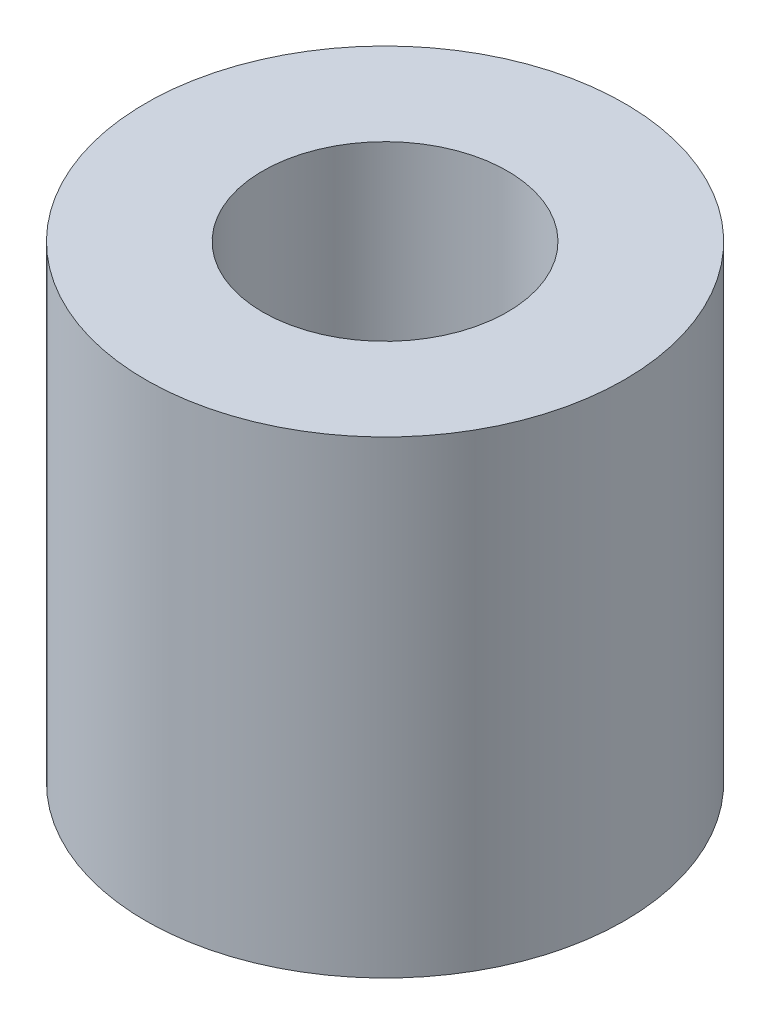
ISO-10303-21;
HEADER;
FILE_DESCRIPTION(('STEP AP214'),'2;1');
FILE_NAME('part.step','',(''),(''),'','','');
FILE_SCHEMA(('AUTOMOTIVE_DESIGN { 1 0 10303 214 1 1 1 1 }'));
ENDSEC;
DATA;
#1=APPLICATION_CONTEXT('core data for automotive mechanical design processes');
#2=APPLICATION_PROTOCOL_DEFINITION('international standard','automotive_design',2000,#1);
#3=PRODUCT_CONTEXT('',#1,'mechanical');
#4=PRODUCT('Part','Part','',(#3));
#5=PRODUCT_RELATED_PRODUCT_CATEGORY('part','',(#4));
#6=PRODUCT_DEFINITION_FORMATION('','',#4);
#7=PRODUCT_DEFINITION_CONTEXT('part definition',#1,'design');
#8=PRODUCT_DEFINITION('design','',#6,#7);
#9=PRODUCT_DEFINITION_SHAPE('','',#8);
#10=(LENGTH_UNIT() NAMED_UNIT(*) SI_UNIT(.MILLI.,.METRE.));
#11=(NAMED_UNIT(*) PLANE_ANGLE_UNIT() SI_UNIT($,.RADIAN.));
#12=(NAMED_UNIT(*) SI_UNIT($,.STERADIAN.) SOLID_ANGLE_UNIT());
#13=UNCERTAINTY_MEASURE_WITH_UNIT(LENGTH_MEASURE(1.E-05),#10,'distance_accuracy_value','');
#14=(GEOMETRIC_REPRESENTATION_CONTEXT(3) GLOBAL_UNCERTAINTY_ASSIGNED_CONTEXT((#13)) GLOBAL_UNIT_ASSIGNED_CONTEXT((#10,
#11,#12)) REPRESENTATION_CONTEXT('',''));
#15=CARTESIAN_POINT('',(0.,0.,0.));
#16=DIRECTION('',(0.,0.,1.));
#17=DIRECTION('',(1.,0.,0.));
#18=AXIS2_PLACEMENT_3D('',#15,#16,#17);
#19=CARTESIAN_POINT('',(0.,10.,0.));
#20=DIRECTION('',(0.,1.,0.));
#21=DIRECTION('',(0.,0.,1.));
#22=AXIS2_PLACEMENT_3D('',#19,#20,#21);
#23=PLANE('',#22);
#24=CARTESIAN_POINT('',(0.,10.,0.));
#25=DIRECTION('',(0.,1.,0.));
#26=DIRECTION('',(1.,0.,0.));
#27=AXIS2_PLACEMENT_3D('',#24,#25,#26);
#28=CIRCLE('',#27,5.11);
#29=CARTESIAN_POINT('',(5.11,10.,0.));
#30=VERTEX_POINT('',#29);
#31=EDGE_CURVE('E11',#30,#30,#28,.T.);
#32=ORIENTED_EDGE('',*,*,#31,.T.);
#33=EDGE_LOOP('',(#32));
#34=FACE_BOUND('',#33,.T.);
#35=CARTESIAN_POINT('',(0.,10.,0.));
#36=DIRECTION('',(0.,1.,0.));
#37=DIRECTION('',(0.,0.,1.));
#38=AXIS2_PLACEMENT_3D('',#35,#36,#37);
#39=CIRCLE('',#38,2.61);
#40=CARTESIAN_POINT('',(0.,10.,2.61));
#41=VERTEX_POINT('',#40);
#42=EDGE_CURVE('E56',#41,#41,#39,.T.);
#43=ORIENTED_EDGE('',*,*,#42,.F.);
#44=EDGE_LOOP('',(#43));
#45=FACE_BOUND('',#44,.T.);
#46=ADVANCED_FACE('F45',(#34,#45),#23,.T.);
#47=CARTESIAN_POINT('',(0.,0.,0.));
#48=DIRECTION('',(0.,1.,0.));
#49=DIRECTION('',(0.,0.,1.));
#50=AXIS2_PLACEMENT_3D('',#47,#48,#49);
#51=PLANE('',#50);
#52=CARTESIAN_POINT('',(0.,0.,0.));
#53=DIRECTION('',(0.,1.,0.));
#54=DIRECTION('',(1.,0.,0.));
#55=AXIS2_PLACEMENT_3D('',#52,#53,#54);
#56=CIRCLE('',#55,5.11);
#57=CARTESIAN_POINT('',(5.11,0.,0.));
#58=VERTEX_POINT('',#57);
#59=EDGE_CURVE('E49',#58,#58,#56,.T.);
#60=ORIENTED_EDGE('',*,*,#59,.F.);
#61=EDGE_LOOP('',(#60));
#62=FACE_BOUND('',#61,.T.);
#63=CARTESIAN_POINT('',(0.,0.,0.));
#64=DIRECTION('',(0.,1.,0.));
#65=DIRECTION('',(0.,0.,1.));
#66=AXIS2_PLACEMENT_3D('',#63,#64,#65);
#67=CIRCLE('',#66,2.61);
#68=CARTESIAN_POINT('',(0.,0.,2.61));
#69=VERTEX_POINT('',#68);
#70=EDGE_CURVE('E58',#69,#69,#67,.T.);
#71=ORIENTED_EDGE('',*,*,#70,.T.);
#72=EDGE_LOOP('',(#71));
#73=FACE_BOUND('',#72,.T.);
#74=ADVANCED_FACE('F68',(#62,#73),#51,.F.);
#75=CARTESIAN_POINT('',(0.,10.,0.));
#76=DIRECTION('',(0.,-1.,0.));
#77=DIRECTION('',(0.,0.,-1.));
#78=AXIS2_PLACEMENT_3D('',#75,#76,#77);
#79=CYLINDRICAL_SURFACE('',#78,5.11);
#80=ORIENTED_EDGE('',*,*,#31,.F.);
#81=EDGE_LOOP('',(#80));
#82=FACE_BOUND('',#81,.T.);
#83=ORIENTED_EDGE('',*,*,#59,.T.);
#84=EDGE_LOOP('',(#83));
#85=FACE_BOUND('',#84,.T.);
#86=ADVANCED_FACE('F47',(#82,#85),#79,.T.);
#87=CARTESIAN_POINT('',(0.,10.,0.));
#88=DIRECTION('',(0.,-1.,0.));
#89=DIRECTION('',(0.,0.,-1.));
#90=AXIS2_PLACEMENT_3D('',#87,#88,#89);
#91=CYLINDRICAL_SURFACE('',#90,2.61);
#92=ORIENTED_EDGE('',*,*,#42,.T.);
#93=EDGE_LOOP('',(#92));
#94=FACE_BOUND('',#93,.T.);
#95=ORIENTED_EDGE('',*,*,#70,.F.);
#96=EDGE_LOOP('',(#95));
#97=FACE_BOUND('',#96,.T.);
#98=ADVANCED_FACE('F64',(#94,#97),#91,.F.);
#99=CLOSED_SHELL('',(#46,#74,#86,#98));
#100=MANIFOLD_SOLID_BREP('B2',#99);
#101=ADVANCED_BREP_SHAPE_REPRESENTATION('',(#18,#100),#14);
#102=SHAPE_DEFINITION_REPRESENTATION(#9,#101);
ENDSEC;
END-ISO-10303-21;
